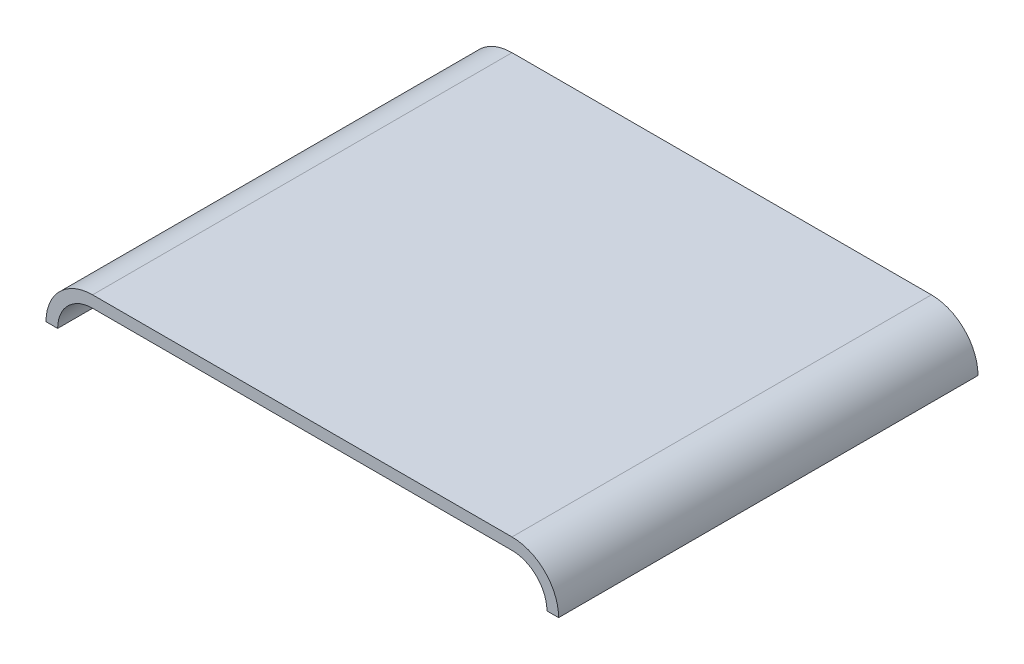
ISO-10303-21;
HEADER;
FILE_DESCRIPTION(('STEP AP214'),'2;1');
FILE_NAME('part.step','',(''),(''),'','','');
FILE_SCHEMA(('AUTOMOTIVE_DESIGN { 1 0 10303 214 1 1 1 1 }'));
ENDSEC;
DATA;
#1=APPLICATION_CONTEXT('core data for automotive mechanical design processes');
#2=APPLICATION_PROTOCOL_DEFINITION('international standard','automotive_design',2000,#1);
#3=PRODUCT_CONTEXT('',#1,'mechanical');
#4=PRODUCT('Part','Part','',(#3));
#5=PRODUCT_RELATED_PRODUCT_CATEGORY('part','',(#4));
#6=PRODUCT_DEFINITION_FORMATION('','',#4);
#7=PRODUCT_DEFINITION_CONTEXT('part definition',#1,'design');
#8=PRODUCT_DEFINITION('design','',#6,#7);
#9=PRODUCT_DEFINITION_SHAPE('','',#8);
#10=(LENGTH_UNIT() NAMED_UNIT(*) SI_UNIT(.MILLI.,.METRE.));
#11=(NAMED_UNIT(*) PLANE_ANGLE_UNIT() SI_UNIT($,.RADIAN.));
#12=(NAMED_UNIT(*) SI_UNIT($,.STERADIAN.) SOLID_ANGLE_UNIT());
#13=UNCERTAINTY_MEASURE_WITH_UNIT(LENGTH_MEASURE(1.E-05),#10,'distance_accuracy_value','');
#14=(GEOMETRIC_REPRESENTATION_CONTEXT(3) GLOBAL_UNCERTAINTY_ASSIGNED_CONTEXT((#13)) GLOBAL_UNIT_ASSIGNED_CONTEXT((#10,
#11,#12)) REPRESENTATION_CONTEXT('',''));
#15=CARTESIAN_POINT('',(0.,0.,0.));
#16=DIRECTION('',(0.,0.,1.));
#17=DIRECTION('',(1.,0.,0.));
#18=AXIS2_PLACEMENT_3D('',#15,#16,#17);
#19=CARTESIAN_POINT('',(228.6,-50.8,457.2));
#20=DIRECTION('',(0.,0.,-1.));
#21=DIRECTION('',(-1.,0.,0.));
#22=AXIS2_PLACEMENT_3D('',#19,#20,#21);
#23=CYLINDRICAL_SURFACE('',#22,38.1);
#24=CARTESIAN_POINT('',(228.6,-50.8,0.));
#25=DIRECTION('',(0.,0.,1.));
#26=DIRECTION('',(1.,0.,0.));
#27=AXIS2_PLACEMENT_3D('',#24,#25,#26);
#28=CIRCLE('',#27,38.1);
#29=CARTESIAN_POINT('',(228.6,-12.7,0.));
#30=VERTEX_POINT('',#29);
#31=CARTESIAN_POINT('',(266.7,-50.8,0.));
#32=VERTEX_POINT('',#31);
#33=EDGE_CURVE('E121',#30,#32,#28,.F.);
#34=ORIENTED_EDGE('',*,*,#33,.T.);
#35=DIRECTION('',(0.,0.,-1.));
#36=VECTOR('',#35,1.);
#37=CARTESIAN_POINT('',(266.7,-50.8,457.2));
#38=LINE('',#37,#36);
#39=CARTESIAN_POINT('',(266.7,-50.8,457.2));
#40=VERTEX_POINT('',#39);
#41=EDGE_CURVE('E12',#40,#32,#38,.T.);
#42=ORIENTED_EDGE('',*,*,#41,.F.);
#43=CARTESIAN_POINT('',(228.6,-50.8,457.2));
#44=DIRECTION('',(0.,0.,1.));
#45=DIRECTION('',(1.,0.,0.));
#46=AXIS2_PLACEMENT_3D('',#43,#44,#45);
#47=CIRCLE('',#46,38.1);
#48=CARTESIAN_POINT('',(228.6,-12.7,457.2));
#49=VERTEX_POINT('',#48);
#50=EDGE_CURVE('E84',#49,#40,#47,.F.);
#51=ORIENTED_EDGE('',*,*,#50,.F.);
#52=DIRECTION('',(0.,0.,-1.));
#53=VECTOR('',#52,1.);
#54=CARTESIAN_POINT('',(228.6,-12.7,457.2));
#55=LINE('',#54,#53);
#56=EDGE_CURVE('E111',#49,#30,#55,.T.);
#57=ORIENTED_EDGE('',*,*,#56,.T.);
#58=EDGE_LOOP('',(#34,#42,#51,#57));
#59=FACE_BOUND('',#58,.T.);
#60=ADVANCED_FACE('F39',(#59),#23,.F.);
#61=CARTESIAN_POINT('',(279.4,-50.8,457.2));
#62=DIRECTION('',(0.,-1.,0.));
#63=DIRECTION('',(0.,0.,-1.));
#64=AXIS2_PLACEMENT_3D('',#61,#62,#63);
#65=PLANE('',#64);
#66=DIRECTION('',(-1.,0.,0.));
#67=VECTOR('',#66,1.);
#68=CARTESIAN_POINT('',(279.4,-50.8,0.));
#69=LINE('',#68,#67);
#70=CARTESIAN_POINT('',(279.4,-50.8,0.));
#71=VERTEX_POINT('',#70);
#72=EDGE_CURVE('E167',#71,#32,#69,.T.);
#73=ORIENTED_EDGE('',*,*,#72,.F.);
#74=DIRECTION('',(0.,0.,-1.));
#75=VECTOR('',#74,1.);
#76=CARTESIAN_POINT('',(279.4,-50.8,457.2));
#77=LINE('',#76,#75);
#78=CARTESIAN_POINT('',(279.4,-50.8,457.2));
#79=VERTEX_POINT('',#78);
#80=EDGE_CURVE('E47',#79,#71,#77,.T.);
#81=ORIENTED_EDGE('',*,*,#80,.F.);
#82=DIRECTION('',(-1.,0.,0.));
#83=VECTOR('',#82,1.);
#84=CARTESIAN_POINT('',(279.4,-50.8,457.2));
#85=LINE('',#84,#83);
#86=EDGE_CURVE('E188',#79,#40,#85,.T.);
#87=ORIENTED_EDGE('',*,*,#86,.T.);
#88=ORIENTED_EDGE('',*,*,#41,.T.);
#89=EDGE_LOOP('',(#73,#81,#87,#88));
#90=FACE_BOUND('',#89,.T.);
#91=ADVANCED_FACE('F168',(#90),#65,.T.);
#92=CARTESIAN_POINT('',(228.6,-50.8,457.2));
#93=DIRECTION('',(0.,0.,-1.));
#94=DIRECTION('',(-1.,0.,0.));
#95=AXIS2_PLACEMENT_3D('',#92,#93,#94);
#96=CYLINDRICAL_SURFACE('',#95,50.8);
#97=CARTESIAN_POINT('',(228.6,-50.8,0.));
#98=DIRECTION('',(0.,0.,-1.));
#99=DIRECTION('',(-1.,0.,0.));
#100=AXIS2_PLACEMENT_3D('',#97,#98,#99);
#101=CIRCLE('',#100,50.8);
#102=CARTESIAN_POINT('',(228.6,0.,0.));
#103=VERTEX_POINT('',#102);
#104=EDGE_CURVE('E152',#103,#71,#101,.T.);
#105=ORIENTED_EDGE('',*,*,#104,.F.);
#106=DIRECTION('',(0.,0.,-1.));
#107=VECTOR('',#106,1.);
#108=CARTESIAN_POINT('',(228.6,0.,457.2));
#109=LINE('',#108,#107);
#110=CARTESIAN_POINT('',(228.6,0.,457.2));
#111=VERTEX_POINT('',#110);
#112=EDGE_CURVE('E72',#111,#103,#109,.T.);
#113=ORIENTED_EDGE('',*,*,#112,.F.);
#114=CARTESIAN_POINT('',(228.6,-50.8,457.2));
#115=DIRECTION('',(0.,0.,-1.));
#116=DIRECTION('',(-1.,0.,0.));
#117=AXIS2_PLACEMENT_3D('',#114,#115,#116);
#118=CIRCLE('',#117,50.8);
#119=EDGE_CURVE('E163',#111,#79,#118,.T.);
#120=ORIENTED_EDGE('',*,*,#119,.T.);
#121=ORIENTED_EDGE('',*,*,#80,.T.);
#122=EDGE_LOOP('',(#105,#113,#120,#121));
#123=FACE_BOUND('',#122,.T.);
#124=ADVANCED_FACE('F160',(#123),#96,.T.);
#125=CARTESIAN_POINT('',(0.,0.,457.2));
#126=DIRECTION('',(0.,1.,0.));
#127=DIRECTION('',(0.,0.,1.));
#128=AXIS2_PLACEMENT_3D('',#125,#126,#127);
#129=PLANE('',#128);
#130=DIRECTION('',(1.,0.,0.));
#131=VECTOR('',#130,1.);
#132=CARTESIAN_POINT('',(0.,0.,0.));
#133=LINE('',#132,#131);
#134=CARTESIAN_POINT('',(-228.6,0.,0.));
#135=VERTEX_POINT('',#134);
#136=EDGE_CURVE('E148',#135,#103,#133,.T.);
#137=ORIENTED_EDGE('',*,*,#136,.F.);
#138=DIRECTION('',(0.,0.,-1.));
#139=VECTOR('',#138,1.);
#140=CARTESIAN_POINT('',(-228.6,0.,457.2));
#141=LINE('',#140,#139);
#142=CARTESIAN_POINT('',(-228.6,0.,457.2));
#143=VERTEX_POINT('',#142);
#144=EDGE_CURVE('E122',#143,#135,#141,.T.);
#145=ORIENTED_EDGE('',*,*,#144,.F.);
#146=DIRECTION('',(1.,0.,0.));
#147=VECTOR('',#146,1.);
#148=CARTESIAN_POINT('',(0.,0.,457.2));
#149=LINE('',#148,#147);
#150=EDGE_CURVE('E113',#143,#111,#149,.T.);
#151=ORIENTED_EDGE('',*,*,#150,.T.);
#152=ORIENTED_EDGE('',*,*,#112,.T.);
#153=EDGE_LOOP('',(#137,#145,#151,#152));
#154=FACE_BOUND('',#153,.T.);
#155=ADVANCED_FACE('F177',(#154),#129,.T.);
#156=CARTESIAN_POINT('',(0.,-12.7,457.2));
#157=DIRECTION('',(0.,1.,0.));
#158=DIRECTION('',(0.,0.,1.));
#159=AXIS2_PLACEMENT_3D('',#156,#157,#158);
#160=PLANE('',#159);
#161=DIRECTION('',(1.,0.,0.));
#162=VECTOR('',#161,1.);
#163=CARTESIAN_POINT('',(0.,-12.7,0.));
#164=LINE('',#163,#162);
#165=CARTESIAN_POINT('',(-228.6,-12.7,0.));
#166=VERTEX_POINT('',#165);
#167=EDGE_CURVE('E79',#166,#30,#164,.T.);
#168=ORIENTED_EDGE('',*,*,#167,.T.);
#169=ORIENTED_EDGE('',*,*,#56,.F.);
#170=DIRECTION('',(1.,0.,0.));
#171=VECTOR('',#170,1.);
#172=CARTESIAN_POINT('',(0.,-12.7,457.2));
#173=LINE('',#172,#171);
#174=CARTESIAN_POINT('',(-228.6,-12.7,457.2));
#175=VERTEX_POINT('',#174);
#176=EDGE_CURVE('E55',#175,#49,#173,.T.);
#177=ORIENTED_EDGE('',*,*,#176,.F.);
#178=DIRECTION('',(0.,0.,-1.));
#179=VECTOR('',#178,1.);
#180=CARTESIAN_POINT('',(-228.6,-12.7,457.2));
#181=LINE('',#180,#179);
#182=EDGE_CURVE('E109',#175,#166,#181,.T.);
#183=ORIENTED_EDGE('',*,*,#182,.T.);
#184=EDGE_LOOP('',(#168,#169,#177,#183));
#185=FACE_BOUND('',#184,.T.);
#186=ADVANCED_FACE('F108',(#185),#160,.F.);
#187=CARTESIAN_POINT('',(228.6,-50.8,457.2));
#188=DIRECTION('',(0.,0.,1.));
#189=DIRECTION('',(1.,0.,0.));
#190=AXIS2_PLACEMENT_3D('',#187,#188,#189);
#191=PLANE('',#190);
#192=ORIENTED_EDGE('',*,*,#50,.T.);
#193=ORIENTED_EDGE('',*,*,#86,.F.);
#194=ORIENTED_EDGE('',*,*,#119,.F.);
#195=ORIENTED_EDGE('',*,*,#150,.F.);
#196=CARTESIAN_POINT('',(-228.6,-50.8,457.2));
#197=DIRECTION('',(0.,0.,1.));
#198=DIRECTION('',(1.,0.,0.));
#199=AXIS2_PLACEMENT_3D('',#196,#197,#198);
#200=CIRCLE('',#199,50.8);
#201=CARTESIAN_POINT('',(-279.4,-50.8,457.2));
#202=VERTEX_POINT('',#201);
#203=EDGE_CURVE('E128',#143,#202,#200,.T.);
#204=ORIENTED_EDGE('',*,*,#203,.T.);
#205=DIRECTION('',(1.,0.,0.));
#206=VECTOR('',#205,1.);
#207=CARTESIAN_POINT('',(-279.4,-50.8,457.2));
#208=LINE('',#207,#206);
#209=CARTESIAN_POINT('',(-266.7,-50.8,457.2));
#210=VERTEX_POINT('',#209);
#211=EDGE_CURVE('E126',#202,#210,#208,.T.);
#212=ORIENTED_EDGE('',*,*,#211,.T.);
#213=CARTESIAN_POINT('',(-228.6,-50.8,457.2));
#214=DIRECTION('',(0.,0.,-1.));
#215=DIRECTION('',(-1.,0.,0.));
#216=AXIS2_PLACEMENT_3D('',#213,#214,#215);
#217=CIRCLE('',#216,38.1);
#218=EDGE_CURVE('E118',#175,#210,#217,.F.);
#219=ORIENTED_EDGE('',*,*,#218,.F.);
#220=ORIENTED_EDGE('',*,*,#176,.T.);
#221=EDGE_LOOP('',(#192,#193,#194,#195,#204,#212,#219,#220));
#222=FACE_BOUND('',#221,.T.);
#223=ADVANCED_FACE('F124',(#222),#191,.T.);
#224=CARTESIAN_POINT('',(228.6,-50.8,0.));
#225=DIRECTION('',(0.,0.,1.));
#226=DIRECTION('',(1.,0.,0.));
#227=AXIS2_PLACEMENT_3D('',#224,#225,#226);
#228=PLANE('',#227);
#229=ORIENTED_EDGE('',*,*,#33,.F.);
#230=ORIENTED_EDGE('',*,*,#167,.F.);
#231=CARTESIAN_POINT('',(-228.6,-50.8,0.));
#232=DIRECTION('',(0.,0.,-1.));
#233=DIRECTION('',(-1.,0.,0.));
#234=AXIS2_PLACEMENT_3D('',#231,#232,#233);
#235=CIRCLE('',#234,38.1);
#236=CARTESIAN_POINT('',(-266.7,-50.8,0.));
#237=VERTEX_POINT('',#236);
#238=EDGE_CURVE('E120',#166,#237,#235,.F.);
#239=ORIENTED_EDGE('',*,*,#238,.T.);
#240=DIRECTION('',(1.,0.,0.));
#241=VECTOR('',#240,1.);
#242=CARTESIAN_POINT('',(-279.4,-50.8,0.));
#243=LINE('',#242,#241);
#244=CARTESIAN_POINT('',(-279.4,-50.8,0.));
#245=VERTEX_POINT('',#244);
#246=EDGE_CURVE('E129',#245,#237,#243,.T.);
#247=ORIENTED_EDGE('',*,*,#246,.F.);
#248=CARTESIAN_POINT('',(-228.6,-50.8,0.));
#249=DIRECTION('',(0.,0.,1.));
#250=DIRECTION('',(1.,0.,0.));
#251=AXIS2_PLACEMENT_3D('',#248,#249,#250);
#252=CIRCLE('',#251,50.8);
#253=EDGE_CURVE('E133',#135,#245,#252,.T.);
#254=ORIENTED_EDGE('',*,*,#253,.F.);
#255=ORIENTED_EDGE('',*,*,#136,.T.);
#256=ORIENTED_EDGE('',*,*,#104,.T.);
#257=ORIENTED_EDGE('',*,*,#72,.T.);
#258=EDGE_LOOP('',(#229,#230,#239,#247,#254,#255,#256,#257));
#259=FACE_BOUND('',#258,.T.);
#260=ADVANCED_FACE('F172',(#259),#228,.F.);
#261=CARTESIAN_POINT('',(-228.6,-50.8,457.2));
#262=DIRECTION('',(0.,0.,-1.));
#263=DIRECTION('',(-1.,0.,0.));
#264=AXIS2_PLACEMENT_3D('',#261,#262,#263);
#265=CYLINDRICAL_SURFACE('',#264,38.1);
#266=ORIENTED_EDGE('',*,*,#238,.F.);
#267=ORIENTED_EDGE('',*,*,#182,.F.);
#268=ORIENTED_EDGE('',*,*,#218,.T.);
#269=DIRECTION('',(0.,0.,-1.));
#270=VECTOR('',#269,1.);
#271=CARTESIAN_POINT('',(-266.7,-50.8,457.2));
#272=LINE('',#271,#270);
#273=EDGE_CURVE('E137',#210,#237,#272,.T.);
#274=ORIENTED_EDGE('',*,*,#273,.T.);
#275=EDGE_LOOP('',(#266,#267,#268,#274));
#276=FACE_BOUND('',#275,.T.);
#277=ADVANCED_FACE('F117',(#276),#265,.F.);
#278=CARTESIAN_POINT('',(-228.6,-50.8,457.2));
#279=DIRECTION('',(0.,0.,-1.));
#280=DIRECTION('',(-1.,0.,0.));
#281=AXIS2_PLACEMENT_3D('',#278,#279,#280);
#282=CYLINDRICAL_SURFACE('',#281,50.8);
#283=ORIENTED_EDGE('',*,*,#253,.T.);
#284=DIRECTION('',(0.,0.,-1.));
#285=VECTOR('',#284,1.);
#286=CARTESIAN_POINT('',(-279.4,-50.8,457.2));
#287=LINE('',#286,#285);
#288=EDGE_CURVE('E183',#202,#245,#287,.T.);
#289=ORIENTED_EDGE('',*,*,#288,.F.);
#290=ORIENTED_EDGE('',*,*,#203,.F.);
#291=ORIENTED_EDGE('',*,*,#144,.T.);
#292=EDGE_LOOP('',(#283,#289,#290,#291));
#293=FACE_BOUND('',#292,.T.);
#294=ADVANCED_FACE('F180',(#293),#282,.T.);
#295=CARTESIAN_POINT('',(-279.4,-50.8,457.2));
#296=DIRECTION('',(0.,1.,0.));
#297=DIRECTION('',(0.,0.,1.));
#298=AXIS2_PLACEMENT_3D('',#295,#296,#297);
#299=PLANE('',#298);
#300=ORIENTED_EDGE('',*,*,#246,.T.);
#301=ORIENTED_EDGE('',*,*,#273,.F.);
#302=ORIENTED_EDGE('',*,*,#211,.F.);
#303=ORIENTED_EDGE('',*,*,#288,.T.);
#304=EDGE_LOOP('',(#300,#301,#302,#303));
#305=FACE_BOUND('',#304,.T.);
#306=ADVANCED_FACE('F195',(#305),#299,.F.);
#307=CLOSED_SHELL('',(#60,#91,#124,#155,#186,#223,#260,#277,#294,#306));
#308=MANIFOLD_SOLID_BREP('B2',#307);
#309=ADVANCED_BREP_SHAPE_REPRESENTATION('',(#18,#308),#14);
#310=SHAPE_DEFINITION_REPRESENTATION(#9,#309);
ENDSEC;
END-ISO-10303-21;
